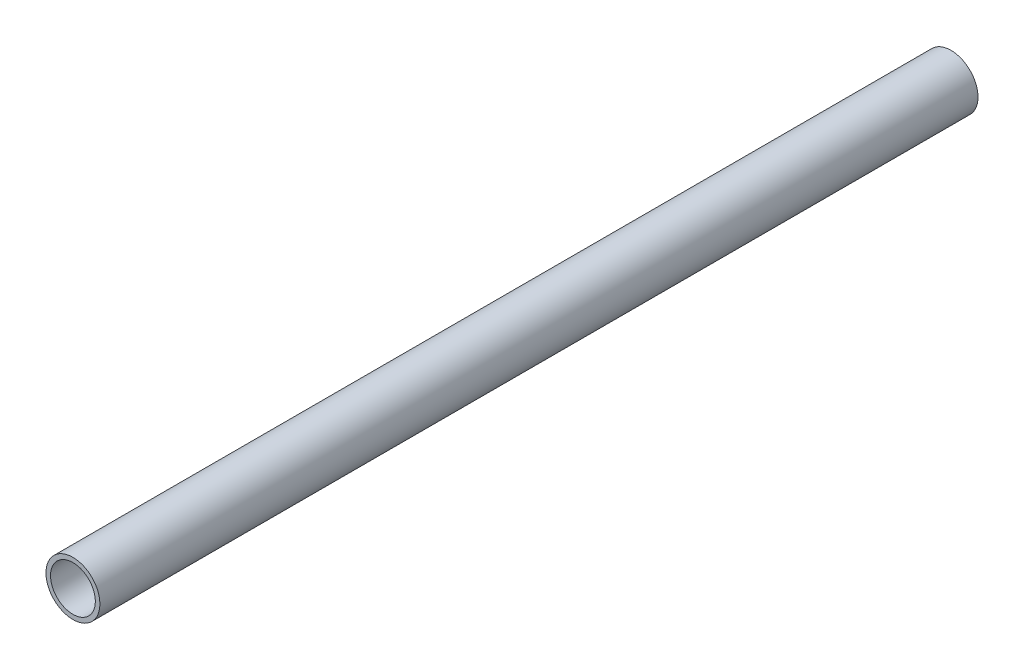
ISO-10303-21;
HEADER;
FILE_DESCRIPTION(('STEP AP214'),'2;1');
FILE_NAME('part.step','',(''),(''),'','','');
FILE_SCHEMA(('AUTOMOTIVE_DESIGN { 1 0 10303 214 1 1 1 1 }'));
ENDSEC;
DATA;
#1=APPLICATION_CONTEXT('core data for automotive mechanical design processes');
#2=APPLICATION_PROTOCOL_DEFINITION('international standard','automotive_design',2000,#1);
#3=PRODUCT_CONTEXT('',#1,'mechanical');
#4=PRODUCT('Part','Part','',(#3));
#5=PRODUCT_RELATED_PRODUCT_CATEGORY('part','',(#4));
#6=PRODUCT_DEFINITION_FORMATION('','',#4);
#7=PRODUCT_DEFINITION_CONTEXT('part definition',#1,'design');
#8=PRODUCT_DEFINITION('design','',#6,#7);
#9=PRODUCT_DEFINITION_SHAPE('','',#8);
#10=(LENGTH_UNIT() NAMED_UNIT(*) SI_UNIT(.MILLI.,.METRE.));
#11=(NAMED_UNIT(*) PLANE_ANGLE_UNIT() SI_UNIT($,.RADIAN.));
#12=(NAMED_UNIT(*) SI_UNIT($,.STERADIAN.) SOLID_ANGLE_UNIT());
#13=UNCERTAINTY_MEASURE_WITH_UNIT(LENGTH_MEASURE(1.E-05),#10,'distance_accuracy_value','');
#14=(GEOMETRIC_REPRESENTATION_CONTEXT(3) GLOBAL_UNCERTAINTY_ASSIGNED_CONTEXT((#13)) GLOBAL_UNIT_ASSIGNED_CONTEXT((#10,
#11,#12)) REPRESENTATION_CONTEXT('',''));
#15=CARTESIAN_POINT('',(0.,0.,0.));
#16=DIRECTION('',(0.,0.,1.));
#17=DIRECTION('',(1.,0.,0.));
#18=AXIS2_PLACEMENT_3D('',#15,#16,#17);
#19=CARTESIAN_POINT('',(164.30625,199.986383101047,-686.355829993514));
#20=DIRECTION('',(0.,0.,1.));
#21=DIRECTION('',(0.,-1.,0.));
#22=AXIS2_PLACEMENT_3D('',#19,#20,#21);
#23=PLANE('',#22);
#24=CARTESIAN_POINT('',(164.30625,199.986383101047,-686.355829993514));
#25=DIRECTION('',(0.,0.,1.));
#26=DIRECTION('',(1.,0.,0.));
#27=AXIS2_PLACEMENT_3D('',#24,#25,#26);
#28=CIRCLE('',#27,21.082);
#29=CARTESIAN_POINT('',(185.38825,199.986383101047,-686.355829993514));
#30=VERTEX_POINT('',#29);
#31=EDGE_CURVE('E67',#30,#30,#28,.F.);
#32=ORIENTED_EDGE('',*,*,#31,.T.);
#33=EDGE_LOOP('',(#32));
#34=FACE_BOUND('',#33,.T.);
#35=CARTESIAN_POINT('',(164.30625,199.986383101047,-686.355829993514));
#36=DIRECTION('',(0.,0.,1.));
#37=DIRECTION('',(1.,0.,0.));
#38=AXIS2_PLACEMENT_3D('',#35,#36,#37);
#39=CIRCLE('',#38,17.526);
#40=CARTESIAN_POINT('',(181.83225,199.986383101047,-686.355829993514));
#41=VERTEX_POINT('',#40);
#42=EDGE_CURVE('E52',#41,#41,#39,.F.);
#43=ORIENTED_EDGE('',*,*,#42,.F.);
#44=EDGE_LOOP('',(#43));
#45=FACE_BOUND('',#44,.T.);
#46=ADVANCED_FACE('F49',(#34,#45),#23,.F.);
#47=CARTESIAN_POINT('',(164.30625,199.986383101047,-745.984730637413));
#48=DIRECTION('',(0.,0.,1.));
#49=DIRECTION('',(1.,0.,0.));
#50=AXIS2_PLACEMENT_3D('',#47,#48,#49);
#51=CYLINDRICAL_SURFACE('',#50,21.082);
#52=ORIENTED_EDGE('',*,*,#31,.F.);
#53=EDGE_LOOP('',(#52));
#54=FACE_BOUND('',#53,.T.);
#55=CARTESIAN_POINT('',(164.30625,199.986383101047,0.));
#56=DIRECTION('',(0.,0.,1.));
#57=DIRECTION('',(1.,0.,0.));
#58=AXIS2_PLACEMENT_3D('',#55,#56,#57);
#59=CIRCLE('',#58,21.082);
#60=CARTESIAN_POINT('',(185.38825,199.986383101047,0.));
#61=VERTEX_POINT('',#60);
#62=EDGE_CURVE('E62',#61,#61,#59,.T.);
#63=ORIENTED_EDGE('',*,*,#62,.F.);
#64=EDGE_LOOP('',(#63));
#65=FACE_BOUND('',#64,.T.);
#66=ADVANCED_FACE('F75',(#54,#65),#51,.T.);
#67=CARTESIAN_POINT('',(164.30625,199.986383101047,0.));
#68=DIRECTION('',(0.,0.,1.));
#69=DIRECTION('',(1.,0.,0.));
#70=AXIS2_PLACEMENT_3D('',#67,#68,#69);
#71=PLANE('',#70);
#72=CARTESIAN_POINT('',(164.30625,199.986383101047,0.));
#73=DIRECTION('',(0.,0.,1.));
#74=DIRECTION('',(1.,0.,0.));
#75=AXIS2_PLACEMENT_3D('',#72,#73,#74);
#76=CIRCLE('',#75,17.526);
#77=CARTESIAN_POINT('',(181.83225,199.986383101047,0.));
#78=VERTEX_POINT('',#77);
#79=EDGE_CURVE('E12',#78,#78,#76,.T.);
#80=ORIENTED_EDGE('',*,*,#79,.F.);
#81=EDGE_LOOP('',(#80));
#82=FACE_BOUND('',#81,.T.);
#83=ORIENTED_EDGE('',*,*,#62,.T.);
#84=EDGE_LOOP('',(#83));
#85=FACE_BOUND('',#84,.T.);
#86=ADVANCED_FACE('F78',(#82,#85),#71,.T.);
#87=CARTESIAN_POINT('',(164.30625,199.986383101047,-745.984730637413));
#88=DIRECTION('',(0.,0.,1.));
#89=DIRECTION('',(1.,0.,0.));
#90=AXIS2_PLACEMENT_3D('',#87,#88,#89);
#91=CYLINDRICAL_SURFACE('',#90,17.526);
#92=ORIENTED_EDGE('',*,*,#42,.T.);
#93=EDGE_LOOP('',(#92));
#94=FACE_BOUND('',#93,.T.);
#95=ORIENTED_EDGE('',*,*,#79,.T.);
#96=EDGE_LOOP('',(#95));
#97=FACE_BOUND('',#96,.T.);
#98=ADVANCED_FACE('F83',(#94,#97),#91,.F.);
#99=CLOSED_SHELL('',(#46,#66,#86,#98));
#100=MANIFOLD_SOLID_BREP('B2',#99);
#101=ADVANCED_BREP_SHAPE_REPRESENTATION('',(#18,#100),#14);
#102=SHAPE_DEFINITION_REPRESENTATION(#9,#101);
ENDSEC;
END-ISO-10303-21;
